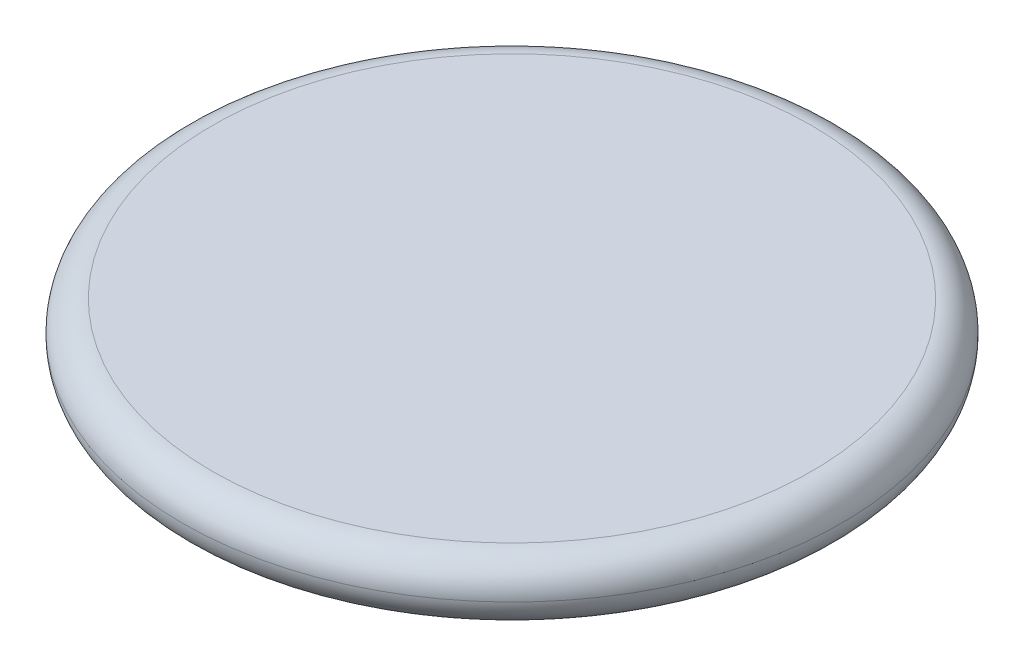
ISO-10303-21;
HEADER;
FILE_DESCRIPTION(('STEP AP214'),'2;1');
FILE_NAME('part.step','',(''),(''),'','','');
FILE_SCHEMA(('AUTOMOTIVE_DESIGN { 1 0 10303 214 1 1 1 1 }'));
ENDSEC;
DATA;
#1=APPLICATION_CONTEXT('core data for automotive mechanical design processes');
#2=APPLICATION_PROTOCOL_DEFINITION('international standard','automotive_design',2000,#1);
#3=PRODUCT_CONTEXT('',#1,'mechanical');
#4=PRODUCT('Part','Part','',(#3));
#5=PRODUCT_RELATED_PRODUCT_CATEGORY('part','',(#4));
#6=PRODUCT_DEFINITION_FORMATION('','',#4);
#7=PRODUCT_DEFINITION_CONTEXT('part definition',#1,'design');
#8=PRODUCT_DEFINITION('design','',#6,#7);
#9=PRODUCT_DEFINITION_SHAPE('','',#8);
#10=(LENGTH_UNIT() NAMED_UNIT(*) SI_UNIT(.MILLI.,.METRE.));
#11=(NAMED_UNIT(*) PLANE_ANGLE_UNIT() SI_UNIT($,.RADIAN.));
#12=(NAMED_UNIT(*) SI_UNIT($,.STERADIAN.) SOLID_ANGLE_UNIT());
#13=UNCERTAINTY_MEASURE_WITH_UNIT(LENGTH_MEASURE(1.E-05),#10,'distance_accuracy_value','');
#14=(GEOMETRIC_REPRESENTATION_CONTEXT(3) GLOBAL_UNCERTAINTY_ASSIGNED_CONTEXT((#13)) GLOBAL_UNIT_ASSIGNED_CONTEXT((#10,
#11,#12)) REPRESENTATION_CONTEXT('',''));
#15=CARTESIAN_POINT('',(0.,0.,0.));
#16=DIRECTION('',(0.,0.,1.));
#17=DIRECTION('',(1.,0.,0.));
#18=AXIS2_PLACEMENT_3D('',#15,#16,#17);
#19=CARTESIAN_POINT('',(0.,-20.,0.));
#20=DIRECTION('',(0.,1.,0.));
#21=DIRECTION('',(0.,0.,1.));
#22=AXIS2_PLACEMENT_3D('',#19,#20,#21);
#23=PLANE('',#22);
#24=CARTESIAN_POINT('',(0.,-20.,0.));
#25=DIRECTION('',(0.,1.,0.));
#26=DIRECTION('',(0.,0.,1.));
#27=AXIS2_PLACEMENT_3D('',#24,#25,#26);
#28=CIRCLE('',#27,200.);
#29=CARTESIAN_POINT('',(0.,-20.,200.));
#30=VERTEX_POINT('',#29);
#31=EDGE_CURVE('E38',#30,#30,#28,.F.);
#32=ORIENTED_EDGE('',*,*,#31,.T.);
#33=EDGE_LOOP('',(#32));
#34=FACE_BOUND('',#33,.T.);
#35=ADVANCED_FACE('F30',(#34),#23,.F.);
#36=CARTESIAN_POINT('',(0.,20.,0.));
#37=DIRECTION('',(0.,1.,0.));
#38=DIRECTION('',(0.,0.,1.));
#39=AXIS2_PLACEMENT_3D('',#36,#37,#38);
#40=PLANE('',#39);
#41=CARTESIAN_POINT('',(0.,20.,0.));
#42=DIRECTION('',(0.,1.,0.));
#43=DIRECTION('',(0.,0.,1.));
#44=AXIS2_PLACEMENT_3D('',#41,#42,#43);
#45=CIRCLE('',#44,200.);
#46=CARTESIAN_POINT('',(0.,20.,200.));
#47=VERTEX_POINT('',#46);
#48=EDGE_CURVE('E10',#47,#47,#45,.T.);
#49=ORIENTED_EDGE('',*,*,#48,.T.);
#50=EDGE_LOOP('',(#49));
#51=FACE_BOUND('',#50,.T.);
#52=ADVANCED_FACE('F51',(#51),#40,.T.);
#53=CARTESIAN_POINT('',(0.,0.,0.));
#54=DIRECTION('',(0.,1.,0.));
#55=DIRECTION('',(0.,0.,1.));
#56=AXIS2_PLACEMENT_3D('',#53,#54,#55);
#57=TOROIDAL_SURFACE('',#56,200.,20.);
#58=ORIENTED_EDGE('',*,*,#48,.F.);
#59=EDGE_LOOP('',(#58));
#60=FACE_BOUND('',#59,.T.);
#61=CARTESIAN_POINT('',(0.,0.,0.));
#62=DIRECTION('',(0.,1.,0.));
#63=DIRECTION('',(0.,0.,1.));
#64=AXIS2_PLACEMENT_3D('',#61,#62,#63);
#65=CIRCLE('',#64,220.);
#66=CARTESIAN_POINT('',(0.,0.,220.));
#67=VERTEX_POINT('',#66);
#68=EDGE_CURVE('E34',#67,#67,#65,.F.);
#69=ORIENTED_EDGE('',*,*,#68,.F.);
#70=EDGE_LOOP('',(#69));
#71=FACE_BOUND('',#70,.T.);
#72=ADVANCED_FACE('F32',(#60,#71),#57,.T.);
#73=CARTESIAN_POINT('',(0.,0.,0.));
#74=DIRECTION('',(0.,1.,0.));
#75=DIRECTION('',(0.,0.,1.));
#76=AXIS2_PLACEMENT_3D('',#73,#74,#75);
#77=TOROIDAL_SURFACE('',#76,200.,20.);
#78=ORIENTED_EDGE('',*,*,#31,.F.);
#79=EDGE_LOOP('',(#78));
#80=FACE_BOUND('',#79,.T.);
#81=ORIENTED_EDGE('',*,*,#68,.T.);
#82=EDGE_LOOP('',(#81));
#83=FACE_BOUND('',#82,.T.);
#84=ADVANCED_FACE('F48',(#80,#83),#77,.T.);
#85=CLOSED_SHELL('',(#35,#52,#72,#84));
#86=MANIFOLD_SOLID_BREP('B2',#85);
#87=ADVANCED_BREP_SHAPE_REPRESENTATION('',(#18,#86),#14);
#88=SHAPE_DEFINITION_REPRESENTATION(#9,#87);
ENDSEC;
END-ISO-10303-21;
